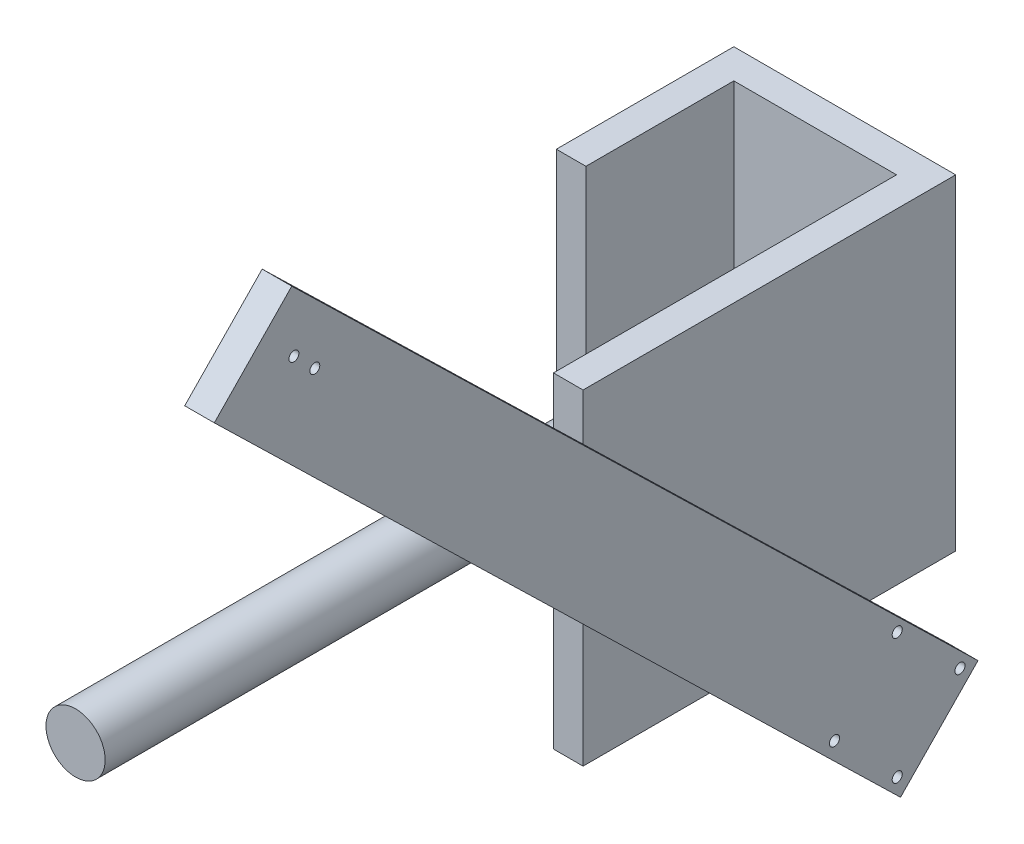
ISO-10303-21;
HEADER;
FILE_DESCRIPTION(('STEP AP214'),'2;1');
FILE_NAME('part.step','',(''),(''),'','','');
FILE_SCHEMA(('AUTOMOTIVE_DESIGN { 1 0 10303 214 1 1 1 1 }'));
ENDSEC;
DATA;
#1=APPLICATION_CONTEXT('core data for automotive mechanical design processes');
#2=APPLICATION_PROTOCOL_DEFINITION('international standard','automotive_design',2000,#1);
#3=PRODUCT_CONTEXT('',#1,'mechanical');
#4=PRODUCT('Part','Part','',(#3));
#5=PRODUCT_RELATED_PRODUCT_CATEGORY('part','',(#4));
#6=PRODUCT_DEFINITION_FORMATION('','',#4);
#7=PRODUCT_DEFINITION_CONTEXT('part definition',#1,'design');
#8=PRODUCT_DEFINITION('design','',#6,#7);
#9=PRODUCT_DEFINITION_SHAPE('','',#8);
#10=(LENGTH_UNIT() NAMED_UNIT(*) SI_UNIT(.MILLI.,.METRE.));
#11=(NAMED_UNIT(*) PLANE_ANGLE_UNIT() SI_UNIT($,.RADIAN.));
#12=(NAMED_UNIT(*) SI_UNIT($,.STERADIAN.) SOLID_ANGLE_UNIT());
#13=UNCERTAINTY_MEASURE_WITH_UNIT(LENGTH_MEASURE(1.E-05),#10,'distance_accuracy_value','');
#14=(GEOMETRIC_REPRESENTATION_CONTEXT(3) GLOBAL_UNCERTAINTY_ASSIGNED_CONTEXT((#13)) GLOBAL_UNIT_ASSIGNED_CONTEXT((#10,
#11,#12)) REPRESENTATION_CONTEXT('',''));
#15=CARTESIAN_POINT('',(0.,0.,0.));
#16=DIRECTION('',(0.,0.,1.));
#17=DIRECTION('',(1.,0.,0.));
#18=AXIS2_PLACEMENT_3D('',#15,#16,#17);
#19=CARTESIAN_POINT('',(-23107.0117553606,5158.44312124506,40788.6350298594));
#20=DIRECTION('',(0.,0.,-1.));
#21=DIRECTION('',(-1.,0.,0.));
#22=AXIS2_PLACEMENT_3D('',#19,#20,#21);
#23=PLANE('',#22);
#24=CARTESIAN_POINT('',(-23032.0117553604,5268.56584962768,40788.6350298594));
#25=DIRECTION('',(0.,0.,-1.));
#26=DIRECTION('',(-1.,0.,0.));
#27=AXIS2_PLACEMENT_3D('',#24,#25,#26);
#28=CIRCLE('',#27,20.000000000001);
#29=CARTESIAN_POINT('',(-23052.0117553604,5268.56584962768,40788.6350298594));
#30=VERTEX_POINT('',#29);
#31=EDGE_CURVE('E11',#30,#30,#28,.F.);
#32=ORIENTED_EDGE('',*,*,#31,.F.);
#33=EDGE_LOOP('',(#32));
#34=FACE_BOUND('',#33,.T.);
#35=DIRECTION('',(0.,1.,0.));
#36=VECTOR('',#35,1.);
#37=CARTESIAN_POINT('',(-23087.0117553604,5158.44312124506,40788.6350298594));
#38=LINE('',#37,#36);
#39=CARTESIAN_POINT('',(-23087.0117553604,5158.44312124506,40788.6350298594));
#40=VERTEX_POINT('',#39);
#41=CARTESIAN_POINT('',(-23087.0117553604,5378.6885780103,40788.6350298594));
#42=VERTEX_POINT('',#41);
#43=EDGE_CURVE('E178',#40,#42,#38,.T.);
#44=ORIENTED_EDGE('',*,*,#43,.F.);
#45=DIRECTION('',(1.,0.,0.));
#46=VECTOR('',#45,1.);
#47=CARTESIAN_POINT('',(-23107.0117553606,5158.44312124506,40788.6350298594));
#48=LINE('',#47,#46);
#49=CARTESIAN_POINT('',(-22977.0117553606,5158.44312124506,40788.6350298594));
#50=VERTEX_POINT('',#49);
#51=EDGE_CURVE('E162',#40,#50,#48,.T.);
#52=ORIENTED_EDGE('',*,*,#51,.T.);
#53=DIRECTION('',(0.,-1.,0.));
#54=VECTOR('',#53,1.);
#55=CARTESIAN_POINT('',(-22977.0117553606,0.,40788.6350298594));
#56=LINE('',#55,#54);
#57=CARTESIAN_POINT('',(-22977.0117553606,5378.6885780103,40788.6350298594));
#58=VERTEX_POINT('',#57);
#59=EDGE_CURVE('E208',#58,#50,#56,.T.);
#60=ORIENTED_EDGE('',*,*,#59,.F.);
#61=DIRECTION('',(1.,0.,0.));
#62=VECTOR('',#61,1.);
#63=CARTESIAN_POINT('',(-23107.0117553606,5378.6885780103,40788.6350298594));
#64=LINE('',#63,#62);
#65=EDGE_CURVE('E202',#42,#58,#64,.T.);
#66=ORIENTED_EDGE('',*,*,#65,.F.);
#67=EDGE_LOOP('',(#44,#52,#60,#66));
#68=FACE_BOUND('',#67,.T.);
#69=ADVANCED_FACE('F41',(#34,#68),#23,.F.);
#70=CARTESIAN_POINT('',(-22957.0117553606,0.,0.));
#71=DIRECTION('',(-1.,0.,0.));
#72=DIRECTION('',(0.,0.,1.));
#73=AXIS2_PLACEMENT_3D('',#70,#71,#72);
#74=PLANE('',#73);
#75=CARTESIAN_POINT('',(-22957.0117553606,5516.1957411759,41236.0441361524));
#76=DIRECTION('',(-1.,0.,0.));
#77=DIRECTION('',(0.,0.,1.));
#78=AXIS2_PLACEMENT_3D('',#75,#76,#77);
#79=CIRCLE('',#78,3.34999999999804);
#80=CARTESIAN_POINT('',(-22957.0117553606,5516.1957411759,41239.3941361524));
#81=VERTEX_POINT('',#80);
#82=EDGE_CURVE('E262',#81,#81,#79,.T.);
#83=ORIENTED_EDGE('',*,*,#82,.F.);
#84=EDGE_LOOP('',(#83));
#85=FACE_BOUND('',#84,.T.);
#86=CARTESIAN_POINT('',(-22957.0117553606,5502.05360554933,41221.9020005312));
#87=DIRECTION('',(-1.,0.,0.));
#88=DIRECTION('',(0.,0.,1.));
#89=AXIS2_PLACEMENT_3D('',#86,#87,#88);
#90=CIRCLE('',#89,3.34999999999804);
#91=CARTESIAN_POINT('',(-22957.0117553606,5502.05360554933,41225.2520005312));
#92=VERTEX_POINT('',#91);
#93=EDGE_CURVE('E256',#92,#92,#90,.T.);
#94=ORIENTED_EDGE('',*,*,#93,.F.);
#95=EDGE_LOOP('',(#94));
#96=FACE_BOUND('',#95,.T.);
#97=DIRECTION('',(0.,-0.697191762299266,-0.716884681508849));
#98=VECTOR('',#97,1.);
#99=CARTESIAN_POINT('',(-22957.0117553606,5557.92935885637,41237.4947792562));
#100=LINE('',#99,#98);
#101=CARTESIAN_POINT('',(-22957.0117553606,5557.92935885637,41237.4947792562));
#102=VERTEX_POINT('',#101);
#103=CARTESIAN_POINT('',(-22957.0117553606,5346.95821498608,41020.5645321428));
#104=VERTEX_POINT('',#103);
#105=EDGE_CURVE('E95',#102,#104,#100,.T.);
#106=ORIENTED_EDGE('',*,*,#105,.T.);
#107=DIRECTION('',(0.,-1.,0.));
#108=VECTOR('',#107,1.);
#109=CARTESIAN_POINT('',(-22957.0117553606,0.,41020.5645321428));
#110=LINE('',#109,#108);
#111=CARTESIAN_POINT('',(-22957.0117553606,5242.18978609648,41020.5645321428));
#112=VERTEX_POINT('',#111);
#113=EDGE_CURVE('E49',#104,#112,#110,.T.);
#114=ORIENTED_EDGE('',*,*,#113,.T.);
#115=DIRECTION('',(0.,0.697191762299266,0.716884681508849));
#116=VECTOR('',#115,1.);
#117=CARTESIAN_POINT('',(-22957.0117553606,5052.91093336638,40825.9392978912));
#118=LINE('',#117,#116);
#119=CARTESIAN_POINT('',(-22957.0117553606,5504.08638583475,41289.8586785229));
#120=VERTEX_POINT('',#119);
#121=EDGE_CURVE('E65',#112,#120,#118,.T.);
#122=ORIENTED_EDGE('',*,*,#121,.T.);
#123=DIRECTION('',(0.,0.716884681508848,-0.697191762299267));
#124=VECTOR('',#123,1.);
#125=CARTESIAN_POINT('',(-22957.0117553606,5504.08638583475,41289.8586785229));
#126=LINE('',#125,#124);
#127=EDGE_CURVE('E268',#120,#102,#126,.T.);
#128=ORIENTED_EDGE('',*,*,#127,.T.);
#129=EDGE_LOOP('',(#106,#114,#122,#128));
#130=FACE_BOUND('',#129,.T.);
#131=ADVANCED_FACE('F311',(#85,#96,#130),#74,.T.);
#132=CARTESIAN_POINT('',(-22957.0117553606,5108.32224656892,40785.7442346742));
#133=DIRECTION('',(-1.,0.,0.));
#134=DIRECTION('',(0.,0.,1.));
#135=AXIS2_PLACEMENT_3D('',#132,#133,#134);
#136=CIRCLE('',#135,3.39999999999935);
#137=CARTESIAN_POINT('',(-22957.0117553606,5108.32224656892,40789.1442346742));
#138=VERTEX_POINT('',#137);
#139=EDGE_CURVE('E232',#138,#138,#136,.T.);
#140=ORIENTED_EDGE('',*,*,#139,.F.);
#141=EDGE_LOOP('',(#140));
#142=FACE_BOUND('',#141,.T.);
#143=CARTESIAN_POINT('',(-22957.0117553606,5065.89583969773,40828.1706415454));
#144=DIRECTION('',(-1.,0.,0.));
#145=DIRECTION('',(0.,0.,1.));
#146=AXIS2_PLACEMENT_3D('',#143,#144,#145);
#147=CIRCLE('',#146,3.39999999999935);
#148=CARTESIAN_POINT('',(-22957.0117553606,5065.89583969773,40831.5706415454));
#149=VERTEX_POINT('',#148);
#150=EDGE_CURVE('E244',#149,#149,#147,.T.);
#151=ORIENTED_EDGE('',*,*,#150,.F.);
#152=EDGE_LOOP('',(#151));
#153=FACE_BOUND('',#152,.T.);
#154=CARTESIAN_POINT('',(-22957.0117553606,5108.32224656892,40870.5970484166));
#155=DIRECTION('',(-1.,0.,0.));
#156=DIRECTION('',(0.,0.,1.));
#157=AXIS2_PLACEMENT_3D('',#154,#155,#156);
#158=CIRCLE('',#157,3.39999999999204);
#159=CARTESIAN_POINT('',(-22957.0117553606,5108.32224656892,40873.9970484166));
#160=VERTEX_POINT('',#159);
#161=EDGE_CURVE('E250',#160,#160,#158,.T.);
#162=ORIENTED_EDGE('',*,*,#161,.F.);
#163=EDGE_LOOP('',(#162));
#164=FACE_BOUND('',#163,.T.);
#165=CARTESIAN_POINT('',(-22957.0117553606,5150.74865344011,40828.1706415454));
#166=DIRECTION('',(-1.,0.,0.));
#167=DIRECTION('',(0.,0.,1.));
#168=AXIS2_PLACEMENT_3D('',#165,#166,#167);
#169=CIRCLE('',#168,3.39999999999935);
#170=CARTESIAN_POINT('',(-22957.0117553606,5150.74865344011,40831.5706415454));
#171=VERTEX_POINT('',#170);
#172=EDGE_CURVE('E238',#171,#171,#169,.T.);
#173=ORIENTED_EDGE('',*,*,#172,.F.);
#174=EDGE_LOOP('',(#173));
#175=FACE_BOUND('',#174,.T.);
#176=CARTESIAN_POINT('',(-22957.0117553606,5052.91093336638,40825.9392978912));
#177=VERTEX_POINT('',#176);
#178=CARTESIAN_POINT('',(-22957.0117553606,5158.44312124506,40934.4523541081));
#179=VERTEX_POINT('',#178);
#180=EDGE_CURVE('E275',#177,#179,#118,.T.);
#181=ORIENTED_EDGE('',*,*,#180,.T.);
#182=DIRECTION('',(0.,0.,-1.));
#183=VECTOR('',#182,1.);
#184=CARTESIAN_POINT('',(-22957.0117553606,5158.44312124506,0.));
#185=LINE('',#184,#183);
#186=CARTESIAN_POINT('',(-22957.0117553606,5158.44312124506,40826.7246300613));
#187=VERTEX_POINT('',#186);
#188=EDGE_CURVE('E224',#179,#187,#185,.T.);
#189=ORIENTED_EDGE('',*,*,#188,.T.);
#190=CARTESIAN_POINT('',(-22957.0117553606,5106.75390638799,40773.5753986245));
#191=VERTEX_POINT('',#190);
#192=EDGE_CURVE('E270',#187,#191,#100,.T.);
#193=ORIENTED_EDGE('',*,*,#192,.T.);
#194=DIRECTION('',(0.,-0.716884681508848,0.697191762299267));
#195=VECTOR('',#194,1.);
#196=CARTESIAN_POINT('',(-22957.0117553606,5106.75390638799,40773.5753986245));
#197=LINE('',#196,#195);
#198=EDGE_CURVE('E272',#191,#177,#197,.T.);
#199=ORIENTED_EDGE('',*,*,#198,.T.);
#200=EDGE_LOOP('',(#181,#189,#193,#199));
#201=FACE_BOUND('',#200,.T.);
#202=ADVANCED_FACE('F344',(#142,#153,#164,#175,#201),#74,.T.);
#203=CARTESIAN_POINT('',(-22937.0117553606,0.,0.));
#204=DIRECTION('',(-1.,0.,0.));
#205=DIRECTION('',(0.,0.,1.));
#206=AXIS2_PLACEMENT_3D('',#203,#204,#205);
#207=PLANE('',#206);
#208=DIRECTION('',(0.,0.716884681508848,-0.697191762299267));
#209=VECTOR('',#208,1.);
#210=CARTESIAN_POINT('',(-22937.0117553606,5504.08638583475,41289.8586785229));
#211=LINE('',#210,#209);
#212=CARTESIAN_POINT('',(-22937.0117553606,5504.08638583475,41289.8586785229));
#213=VERTEX_POINT('',#212);
#214=CARTESIAN_POINT('',(-22937.0117553606,5557.92935885637,41237.4947792562));
#215=VERTEX_POINT('',#214);
#216=EDGE_CURVE('E265',#213,#215,#211,.T.);
#217=ORIENTED_EDGE('',*,*,#216,.F.);
#218=DIRECTION('',(0.,0.697191762299266,0.716884681508849));
#219=VECTOR('',#218,1.);
#220=CARTESIAN_POINT('',(-22937.0117553606,5052.91093336638,40825.9392978912));
#221=LINE('',#220,#219);
#222=CARTESIAN_POINT('',(-22937.0117553606,5052.91093336638,40825.9392978912));
#223=VERTEX_POINT('',#222);
#224=EDGE_CURVE('E87',#223,#213,#221,.T.);
#225=ORIENTED_EDGE('',*,*,#224,.F.);
#226=DIRECTION('',(0.,-0.716884681508848,0.697191762299267));
#227=VECTOR('',#226,1.);
#228=CARTESIAN_POINT('',(-22937.0117553606,5106.75390638799,40773.5753986245));
#229=LINE('',#228,#227);
#230=CARTESIAN_POINT('',(-22937.0117553606,5106.75390638799,40773.5753986245));
#231=VERTEX_POINT('',#230);
#232=EDGE_CURVE('E284',#231,#223,#229,.T.);
#233=ORIENTED_EDGE('',*,*,#232,.F.);
#234=DIRECTION('',(0.,-0.697191762299266,-0.716884681508849));
#235=VECTOR('',#234,1.);
#236=CARTESIAN_POINT('',(-22937.0117553606,5557.92935885637,41237.4947792562));
#237=LINE('',#236,#235);
#238=EDGE_CURVE('E282',#215,#231,#237,.T.);
#239=ORIENTED_EDGE('',*,*,#238,.F.);
#240=EDGE_LOOP('',(#217,#225,#233,#239));
#241=FACE_BOUND('',#240,.T.);
#242=CARTESIAN_POINT('',(-22937.0117553606,5516.1957411759,41236.0441361524));
#243=DIRECTION('',(-1.,0.,0.));
#244=DIRECTION('',(0.,0.,1.));
#245=AXIS2_PLACEMENT_3D('',#242,#243,#244);
#246=CIRCLE('',#245,3.34999999999804);
#247=CARTESIAN_POINT('',(-22937.0117553606,5516.1957411759,41239.3941361524));
#248=VERTEX_POINT('',#247);
#249=EDGE_CURVE('E259',#248,#248,#246,.T.);
#250=ORIENTED_EDGE('',*,*,#249,.T.);
#251=EDGE_LOOP('',(#250));
#252=FACE_BOUND('',#251,.T.);
#253=CARTESIAN_POINT('',(-22937.0117553606,5502.05360554933,41221.9020005312));
#254=DIRECTION('',(-1.,0.,0.));
#255=DIRECTION('',(0.,0.,1.));
#256=AXIS2_PLACEMENT_3D('',#253,#254,#255);
#257=CIRCLE('',#256,3.34999999999804);
#258=CARTESIAN_POINT('',(-22937.0117553606,5502.05360554933,41225.2520005312));
#259=VERTEX_POINT('',#258);
#260=EDGE_CURVE('E253',#259,#259,#257,.T.);
#261=ORIENTED_EDGE('',*,*,#260,.T.);
#262=EDGE_LOOP('',(#261));
#263=FACE_BOUND('',#262,.T.);
#264=CARTESIAN_POINT('',(-22937.0117553606,5108.32224656892,40870.5970484166));
#265=DIRECTION('',(-1.,0.,0.));
#266=DIRECTION('',(0.,0.,1.));
#267=AXIS2_PLACEMENT_3D('',#264,#265,#266);
#268=CIRCLE('',#267,3.39999999999204);
#269=CARTESIAN_POINT('',(-22937.0117553606,5108.32224656892,40873.9970484166));
#270=VERTEX_POINT('',#269);
#271=EDGE_CURVE('E247',#270,#270,#268,.T.);
#272=ORIENTED_EDGE('',*,*,#271,.T.);
#273=EDGE_LOOP('',(#272));
#274=FACE_BOUND('',#273,.T.);
#275=CARTESIAN_POINT('',(-22937.0117553606,5065.89583969773,40828.1706415454));
#276=DIRECTION('',(-1.,0.,0.));
#277=DIRECTION('',(0.,0.,1.));
#278=AXIS2_PLACEMENT_3D('',#275,#276,#277);
#279=CIRCLE('',#278,3.39999999999935);
#280=CARTESIAN_POINT('',(-22937.0117553606,5065.89583969773,40831.5706415454));
#281=VERTEX_POINT('',#280);
#282=EDGE_CURVE('E241',#281,#281,#279,.T.);
#283=ORIENTED_EDGE('',*,*,#282,.T.);
#284=EDGE_LOOP('',(#283));
#285=FACE_BOUND('',#284,.T.);
#286=CARTESIAN_POINT('',(-22937.0117553606,5150.74865344011,40828.1706415454));
#287=DIRECTION('',(-1.,0.,0.));
#288=DIRECTION('',(0.,0.,1.));
#289=AXIS2_PLACEMENT_3D('',#286,#287,#288);
#290=CIRCLE('',#289,3.39999999999935);
#291=CARTESIAN_POINT('',(-22937.0117553606,5150.74865344011,40831.5706415454));
#292=VERTEX_POINT('',#291);
#293=EDGE_CURVE('E235',#292,#292,#290,.T.);
#294=ORIENTED_EDGE('',*,*,#293,.T.);
#295=EDGE_LOOP('',(#294));
#296=FACE_BOUND('',#295,.T.);
#297=CARTESIAN_POINT('',(-22937.0117553606,5108.32224656892,40785.7442346742));
#298=DIRECTION('',(-1.,0.,0.));
#299=DIRECTION('',(0.,0.,1.));
#300=AXIS2_PLACEMENT_3D('',#297,#298,#299);
#301=CIRCLE('',#300,3.39999999999935);
#302=CARTESIAN_POINT('',(-22937.0117553606,5108.32224656892,40789.1442346742));
#303=VERTEX_POINT('',#302);
#304=EDGE_CURVE('E231',#303,#303,#301,.T.);
#305=ORIENTED_EDGE('',*,*,#304,.T.);
#306=EDGE_LOOP('',(#305));
#307=FACE_BOUND('',#306,.T.);
#308=ADVANCED_FACE('F384',(#241,#252,#263,#274,#285,#296,#307),#207,.F.);
#309=CARTESIAN_POINT('',(-22957.0117553606,5504.08638583475,41289.8586785229));
#310=DIRECTION('',(0.,-0.697191762299267,-0.716884681508848));
#311=DIRECTION('',(0.,0.716884681508848,-0.697191762299267));
#312=AXIS2_PLACEMENT_3D('',#309,#310,#311);
#313=PLANE('',#312);
#314=ORIENTED_EDGE('',*,*,#216,.T.);
#315=DIRECTION('',(1.,0.,0.));
#316=VECTOR('',#315,1.);
#317=CARTESIAN_POINT('',(-22957.0117553606,5557.92935885637,41237.4947792562));
#318=LINE('',#317,#316);
#319=EDGE_CURVE('E292',#102,#215,#318,.T.);
#320=ORIENTED_EDGE('',*,*,#319,.F.);
#321=ORIENTED_EDGE('',*,*,#127,.F.);
#322=DIRECTION('',(1.,0.,0.));
#323=VECTOR('',#322,1.);
#324=CARTESIAN_POINT('',(-22957.0117553606,5504.08638583475,41289.8586785229));
#325=LINE('',#324,#323);
#326=EDGE_CURVE('E278',#120,#213,#325,.T.);
#327=ORIENTED_EDGE('',*,*,#326,.T.);
#328=EDGE_LOOP('',(#314,#320,#321,#327));
#329=FACE_BOUND('',#328,.T.);
#330=ADVANCED_FACE('F43',(#329),#313,.F.);
#331=CARTESIAN_POINT('',(-22957.0117553606,5557.92935885637,41237.4947792562));
#332=DIRECTION('',(0.,-0.716884681508849,0.697191762299266));
#333=DIRECTION('',(0.,-0.697191762299266,-0.716884681508849));
#334=AXIS2_PLACEMENT_3D('',#331,#332,#333);
#335=PLANE('',#334);
#336=ORIENTED_EDGE('',*,*,#238,.T.);
#337=DIRECTION('',(1.,0.,0.));
#338=VECTOR('',#337,1.);
#339=CARTESIAN_POINT('',(-22957.0117553606,5106.75390638799,40773.5753986245));
#340=LINE('',#339,#338);
#341=EDGE_CURVE('E290',#191,#231,#340,.T.);
#342=ORIENTED_EDGE('',*,*,#341,.F.);
#343=ORIENTED_EDGE('',*,*,#192,.F.);
#344=EDGE_CURVE('E273',#104,#187,#100,.T.);
#345=ORIENTED_EDGE('',*,*,#344,.F.);
#346=ORIENTED_EDGE('',*,*,#105,.F.);
#347=ORIENTED_EDGE('',*,*,#319,.T.);
#348=EDGE_LOOP('',(#336,#342,#343,#345,#346,#347));
#349=FACE_BOUND('',#348,.T.);
#350=ADVANCED_FACE('F392',(#349),#335,.F.);
#351=CARTESIAN_POINT('',(-22957.0117553606,5106.75390638799,40773.5753986245));
#352=DIRECTION('',(0.,0.697191762299267,0.716884681508848));
#353=DIRECTION('',(0.,-0.716884681508848,0.697191762299267));
#354=AXIS2_PLACEMENT_3D('',#351,#352,#353);
#355=PLANE('',#354);
#356=ORIENTED_EDGE('',*,*,#232,.T.);
#357=DIRECTION('',(1.,0.,0.));
#358=VECTOR('',#357,1.);
#359=CARTESIAN_POINT('',(-22957.0117553606,5052.91093336638,40825.9392978912));
#360=LINE('',#359,#358);
#361=EDGE_CURVE('E288',#177,#223,#360,.T.);
#362=ORIENTED_EDGE('',*,*,#361,.F.);
#363=ORIENTED_EDGE('',*,*,#198,.F.);
#364=ORIENTED_EDGE('',*,*,#341,.T.);
#365=EDGE_LOOP('',(#356,#362,#363,#364));
#366=FACE_BOUND('',#365,.T.);
#367=ADVANCED_FACE('F390',(#366),#355,.F.);
#368=CARTESIAN_POINT('',(-22957.0117553606,5052.91093336638,40825.9392978912));
#369=DIRECTION('',(0.,0.716884681508849,-0.697191762299266));
#370=DIRECTION('',(0.,0.697191762299266,0.716884681508849));
#371=AXIS2_PLACEMENT_3D('',#368,#369,#370);
#372=PLANE('',#371);
#373=ORIENTED_EDGE('',*,*,#224,.T.);
#374=ORIENTED_EDGE('',*,*,#326,.F.);
#375=ORIENTED_EDGE('',*,*,#121,.F.);
#376=EDGE_CURVE('E279',#179,#112,#118,.T.);
#377=ORIENTED_EDGE('',*,*,#376,.F.);
#378=ORIENTED_EDGE('',*,*,#180,.F.);
#379=ORIENTED_EDGE('',*,*,#361,.T.);
#380=EDGE_LOOP('',(#373,#374,#375,#377,#378,#379));
#381=FACE_BOUND('',#380,.T.);
#382=ADVANCED_FACE('F313',(#381),#372,.F.);
#383=CARTESIAN_POINT('',(-22957.0117553606,5516.1957411759,41236.0441361524));
#384=DIRECTION('',(1.,0.,0.));
#385=DIRECTION('',(0.,0.,-1.));
#386=AXIS2_PLACEMENT_3D('',#383,#384,#385);
#387=CYLINDRICAL_SURFACE('',#386,3.34999999999804);
#388=ORIENTED_EDGE('',*,*,#82,.T.);
#389=EDGE_LOOP('',(#388));
#390=FACE_BOUND('',#389,.T.);
#391=ORIENTED_EDGE('',*,*,#249,.F.);
#392=EDGE_LOOP('',(#391));
#393=FACE_BOUND('',#392,.T.);
#394=ADVANCED_FACE('F379',(#390,#393),#387,.F.);
#395=CARTESIAN_POINT('',(-22957.0117553606,5502.05360554933,41221.9020005312));
#396=DIRECTION('',(1.,0.,0.));
#397=DIRECTION('',(0.,0.,-1.));
#398=AXIS2_PLACEMENT_3D('',#395,#396,#397);
#399=CYLINDRICAL_SURFACE('',#398,3.34999999999804);
#400=ORIENTED_EDGE('',*,*,#93,.T.);
#401=EDGE_LOOP('',(#400));
#402=FACE_BOUND('',#401,.T.);
#403=ORIENTED_EDGE('',*,*,#260,.F.);
#404=EDGE_LOOP('',(#403));
#405=FACE_BOUND('',#404,.T.);
#406=ADVANCED_FACE('F375',(#402,#405),#399,.F.);
#407=CARTESIAN_POINT('',(-22957.0117553606,5108.32224656892,40870.5970484166));
#408=DIRECTION('',(1.,0.,0.));
#409=DIRECTION('',(0.,0.,-1.));
#410=AXIS2_PLACEMENT_3D('',#407,#408,#409);
#411=CYLINDRICAL_SURFACE('',#410,3.39999999999204);
#412=ORIENTED_EDGE('',*,*,#161,.T.);
#413=EDGE_LOOP('',(#412));
#414=FACE_BOUND('',#413,.T.);
#415=ORIENTED_EDGE('',*,*,#271,.F.);
#416=EDGE_LOOP('',(#415));
#417=FACE_BOUND('',#416,.T.);
#418=ADVANCED_FACE('F371',(#414,#417),#411,.F.);
#419=CARTESIAN_POINT('',(-22957.0117553606,5065.89583969773,40828.1706415454));
#420=DIRECTION('',(1.,0.,0.));
#421=DIRECTION('',(0.,0.,-1.));
#422=AXIS2_PLACEMENT_3D('',#419,#420,#421);
#423=CYLINDRICAL_SURFACE('',#422,3.39999999999935);
#424=ORIENTED_EDGE('',*,*,#150,.T.);
#425=EDGE_LOOP('',(#424));
#426=FACE_BOUND('',#425,.T.);
#427=ORIENTED_EDGE('',*,*,#282,.F.);
#428=EDGE_LOOP('',(#427));
#429=FACE_BOUND('',#428,.T.);
#430=ADVANCED_FACE('F367',(#426,#429),#423,.F.);
#431=CARTESIAN_POINT('',(-22957.0117553606,5150.74865344011,40828.1706415454));
#432=DIRECTION('',(1.,0.,0.));
#433=DIRECTION('',(0.,0.,-1.));
#434=AXIS2_PLACEMENT_3D('',#431,#432,#433);
#435=CYLINDRICAL_SURFACE('',#434,3.39999999999935);
#436=ORIENTED_EDGE('',*,*,#172,.T.);
#437=EDGE_LOOP('',(#436));
#438=FACE_BOUND('',#437,.T.);
#439=ORIENTED_EDGE('',*,*,#293,.F.);
#440=EDGE_LOOP('',(#439));
#441=FACE_BOUND('',#440,.T.);
#442=ADVANCED_FACE('F363',(#438,#441),#435,.F.);
#443=CARTESIAN_POINT('',(-22957.0117553606,5108.32224656892,40785.7442346742));
#444=DIRECTION('',(1.,0.,0.));
#445=DIRECTION('',(0.,0.,-1.));
#446=AXIS2_PLACEMENT_3D('',#443,#444,#445);
#447=CYLINDRICAL_SURFACE('',#446,3.39999999999935);
#448=ORIENTED_EDGE('',*,*,#139,.T.);
#449=EDGE_LOOP('',(#448));
#450=FACE_BOUND('',#449,.T.);
#451=ORIENTED_EDGE('',*,*,#304,.F.);
#452=EDGE_LOOP('',(#451));
#453=FACE_BOUND('',#452,.T.);
#454=ADVANCED_FACE('F354',(#450,#453),#447,.F.);
#455=CARTESIAN_POINT('',(-22957.0117553606,0.,0.));
#456=DIRECTION('',(-1.,0.,0.));
#457=DIRECTION('',(0.,0.,1.));
#458=AXIS2_PLACEMENT_3D('',#455,#456,#457);
#459=PLANE('',#458);
#460=CARTESIAN_POINT('',(-22957.0117553606,5378.6885780103,41020.5645321428));
#461=VERTEX_POINT('',#460);
#462=EDGE_CURVE('E209',#461,#104,#110,.T.);
#463=ORIENTED_EDGE('',*,*,#462,.T.);
#464=ORIENTED_EDGE('',*,*,#344,.T.);
#465=CARTESIAN_POINT('',(-22957.0117553606,5158.44312124506,40768.6350298594));
#466=VERTEX_POINT('',#465);
#467=EDGE_CURVE('E56',#187,#466,#185,.T.);
#468=ORIENTED_EDGE('',*,*,#467,.T.);
#469=DIRECTION('',(0.,-1.,0.));
#470=VECTOR('',#469,1.);
#471=CARTESIAN_POINT('',(-22957.0117553606,5158.44312124506,40768.6350298594));
#472=LINE('',#471,#470);
#473=CARTESIAN_POINT('',(-22957.0117553606,5378.6885780103,40768.6350298594));
#474=VERTEX_POINT('',#473);
#475=EDGE_CURVE('E190',#474,#466,#472,.T.);
#476=ORIENTED_EDGE('',*,*,#475,.F.);
#477=DIRECTION('',(0.,0.,-1.));
#478=VECTOR('',#477,1.);
#479=CARTESIAN_POINT('',(-22957.0117553606,5378.6885780103,0.));
#480=LINE('',#479,#478);
#481=EDGE_CURVE('E204',#461,#474,#480,.T.);
#482=ORIENTED_EDGE('',*,*,#481,.F.);
#483=EDGE_LOOP('',(#463,#464,#468,#476,#482));
#484=FACE_BOUND('',#483,.T.);
#485=ADVANCED_FACE('F299',(#484),#459,.F.);
#486=CARTESIAN_POINT('',(-22957.0117553606,5158.44312124506,41020.5645321428));
#487=VERTEX_POINT('',#486);
#488=EDGE_CURVE('E220',#487,#179,#185,.T.);
#489=ORIENTED_EDGE('',*,*,#488,.T.);
#490=ORIENTED_EDGE('',*,*,#376,.T.);
#491=EDGE_CURVE('E223',#112,#487,#110,.T.);
#492=ORIENTED_EDGE('',*,*,#491,.T.);
#493=EDGE_LOOP('',(#489,#490,#492));
#494=FACE_BOUND('',#493,.T.);
#495=ADVANCED_FACE('F317',(#494),#459,.F.);
#496=CARTESIAN_POINT('',(-22977.0117553606,5378.6885780103,0.));
#497=DIRECTION('',(0.,-1.,0.));
#498=DIRECTION('',(0.,0.,-1.));
#499=AXIS2_PLACEMENT_3D('',#496,#497,#498);
#500=PLANE('',#499);
#501=ORIENTED_EDGE('',*,*,#481,.T.);
#502=DIRECTION('',(1.,0.,0.));
#503=VECTOR('',#502,1.);
#504=CARTESIAN_POINT('',(-23107.0117553606,5378.6885780103,40768.6350298594));
#505=LINE('',#504,#503);
#506=CARTESIAN_POINT('',(-23107.0117553606,5378.6885780103,40768.6350298594));
#507=VERTEX_POINT('',#506);
#508=EDGE_CURVE('E199',#507,#474,#505,.T.);
#509=ORIENTED_EDGE('',*,*,#508,.F.);
#510=DIRECTION('',(0.,0.,-1.));
#511=VECTOR('',#510,1.);
#512=CARTESIAN_POINT('',(-23107.0117553606,5378.6885780103,40788.6350298594));
#513=LINE('',#512,#511);
#514=CARTESIAN_POINT('',(-23107.0117553604,5378.6885780103,40888.6350298594));
#515=VERTEX_POINT('',#514);
#516=EDGE_CURVE('E191',#515,#507,#513,.T.);
#517=ORIENTED_EDGE('',*,*,#516,.F.);
#518=DIRECTION('',(-1.,0.,0.));
#519=VECTOR('',#518,1.);
#520=CARTESIAN_POINT('',(-23107.0117553604,5378.6885780103,40888.6350298594));
#521=LINE('',#520,#519);
#522=CARTESIAN_POINT('',(-23087.0117553604,5378.6885780103,40888.6350298594));
#523=VERTEX_POINT('',#522);
#524=EDGE_CURVE('E177',#523,#515,#521,.T.);
#525=ORIENTED_EDGE('',*,*,#524,.F.);
#526=DIRECTION('',(0.,0.,-1.));
#527=VECTOR('',#526,1.);
#528=CARTESIAN_POINT('',(-23087.0117553604,5378.6885780103,40888.6350298594));
#529=LINE('',#528,#527);
#530=EDGE_CURVE('E185',#523,#42,#529,.T.);
#531=ORIENTED_EDGE('',*,*,#530,.T.);
#532=ORIENTED_EDGE('',*,*,#65,.T.);
#533=DIRECTION('',(0.,0.,-1.));
#534=VECTOR('',#533,1.);
#535=CARTESIAN_POINT('',(-22977.0117553606,5378.6885780103,0.));
#536=LINE('',#535,#534);
#537=CARTESIAN_POINT('',(-22977.0117553606,5378.6885780103,41020.5645321428));
#538=VERTEX_POINT('',#537);
#539=EDGE_CURVE('E205',#538,#58,#536,.T.);
#540=ORIENTED_EDGE('',*,*,#539,.F.);
#541=DIRECTION('',(1.,0.,0.));
#542=VECTOR('',#541,1.);
#543=CARTESIAN_POINT('',(-22977.0117553606,5378.6885780103,41020.5645321428));
#544=LINE('',#543,#542);
#545=EDGE_CURVE('E218',#538,#461,#544,.T.);
#546=ORIENTED_EDGE('',*,*,#545,.T.);
#547=EDGE_LOOP('',(#501,#509,#517,#525,#531,#532,#540,#546));
#548=FACE_BOUND('',#547,.T.);
#549=ADVANCED_FACE('F305',(#548),#500,.F.);
#550=CARTESIAN_POINT('',(-22977.0117553606,5158.44312124506,0.));
#551=DIRECTION('',(0.,-1.,0.));
#552=DIRECTION('',(0.,0.,-1.));
#553=AXIS2_PLACEMENT_3D('',#550,#551,#552);
#554=PLANE('',#553);
#555=ORIENTED_EDGE('',*,*,#488,.F.);
#556=DIRECTION('',(1.,0.,0.));
#557=VECTOR('',#556,1.);
#558=CARTESIAN_POINT('',(-22977.0117553606,5158.44312124506,41020.5645321428));
#559=LINE('',#558,#557);
#560=CARTESIAN_POINT('',(-22977.0117553606,5158.44312124506,41020.5645321428));
#561=VERTEX_POINT('',#560);
#562=EDGE_CURVE('E228',#561,#487,#559,.T.);
#563=ORIENTED_EDGE('',*,*,#562,.F.);
#564=DIRECTION('',(0.,0.,-1.));
#565=VECTOR('',#564,1.);
#566=CARTESIAN_POINT('',(-22977.0117553606,5158.44312124506,0.));
#567=LINE('',#566,#565);
#568=EDGE_CURVE('E212',#561,#50,#567,.T.);
#569=ORIENTED_EDGE('',*,*,#568,.T.);
#570=ORIENTED_EDGE('',*,*,#51,.F.);
#571=DIRECTION('',(0.,0.,-1.));
#572=VECTOR('',#571,1.);
#573=CARTESIAN_POINT('',(-23087.0117553604,5158.44312124506,40888.6350298594));
#574=LINE('',#573,#572);
#575=CARTESIAN_POINT('',(-23087.0117553604,5158.44312124506,40888.6350298594));
#576=VERTEX_POINT('',#575);
#577=EDGE_CURVE('E169',#576,#40,#574,.T.);
#578=ORIENTED_EDGE('',*,*,#577,.F.);
#579=DIRECTION('',(1.,0.,0.));
#580=VECTOR('',#579,1.);
#581=CARTESIAN_POINT('',(-23107.0117553604,5158.44312124506,40888.6350298594));
#582=LINE('',#581,#580);
#583=CARTESIAN_POINT('',(-23107.0117553604,5158.44312124506,40888.6350298594));
#584=VERTEX_POINT('',#583);
#585=EDGE_CURVE('E165',#584,#576,#582,.T.);
#586=ORIENTED_EDGE('',*,*,#585,.F.);
#587=DIRECTION('',(0.,0.,1.));
#588=VECTOR('',#587,1.);
#589=CARTESIAN_POINT('',(-23107.0117553606,5158.44312124506,40788.6350298594));
#590=LINE('',#589,#588);
#591=CARTESIAN_POINT('',(-23107.0117553606,5158.44312124506,40768.6350298594));
#592=VERTEX_POINT('',#591);
#593=EDGE_CURVE('E154',#592,#584,#590,.T.);
#594=ORIENTED_EDGE('',*,*,#593,.F.);
#595=DIRECTION('',(1.,0.,0.));
#596=VECTOR('',#595,1.);
#597=CARTESIAN_POINT('',(-23107.0117553606,5158.44312124506,40768.6350298594));
#598=LINE('',#597,#596);
#599=EDGE_CURVE('E197',#592,#466,#598,.T.);
#600=ORIENTED_EDGE('',*,*,#599,.T.);
#601=ORIENTED_EDGE('',*,*,#467,.F.);
#602=ORIENTED_EDGE('',*,*,#188,.F.);
#603=EDGE_LOOP('',(#555,#563,#569,#570,#578,#586,#594,#600,#601,#602));
#604=FACE_BOUND('',#603,.T.);
#605=ADVANCED_FACE('F167',(#604),#554,.T.);
#606=CARTESIAN_POINT('',(-22977.0117553606,0.,41020.5645321428));
#607=DIRECTION('',(0.,0.,1.));
#608=DIRECTION('',(1.,0.,0.));
#609=AXIS2_PLACEMENT_3D('',#606,#607,#608);
#610=PLANE('',#609);
#611=ORIENTED_EDGE('',*,*,#462,.F.);
#612=ORIENTED_EDGE('',*,*,#545,.F.);
#613=DIRECTION('',(0.,-1.,0.));
#614=VECTOR('',#613,1.);
#615=CARTESIAN_POINT('',(-22977.0117553606,0.,41020.5645321428));
#616=LINE('',#615,#614);
#617=EDGE_CURVE('E215',#538,#561,#616,.T.);
#618=ORIENTED_EDGE('',*,*,#617,.T.);
#619=ORIENTED_EDGE('',*,*,#562,.T.);
#620=ORIENTED_EDGE('',*,*,#491,.F.);
#621=ORIENTED_EDGE('',*,*,#113,.F.);
#622=EDGE_LOOP('',(#611,#612,#618,#619,#620,#621));
#623=FACE_BOUND('',#622,.T.);
#624=ADVANCED_FACE('F309',(#623),#610,.T.);
#625=CARTESIAN_POINT('',(-22977.0117553606,0.,0.));
#626=DIRECTION('',(-1.,0.,0.));
#627=DIRECTION('',(0.,0.,1.));
#628=AXIS2_PLACEMENT_3D('',#625,#626,#627);
#629=PLANE('',#628);
#630=ORIENTED_EDGE('',*,*,#539,.T.);
#631=ORIENTED_EDGE('',*,*,#59,.T.);
#632=ORIENTED_EDGE('',*,*,#568,.F.);
#633=ORIENTED_EDGE('',*,*,#617,.F.);
#634=EDGE_LOOP('',(#630,#631,#632,#633));
#635=FACE_BOUND('',#634,.T.);
#636=ADVANCED_FACE('F321',(#635),#629,.T.);
#637=CARTESIAN_POINT('',(-23107.0117553606,5158.44312124506,40768.6350298594));
#638=DIRECTION('',(0.,0.,1.));
#639=DIRECTION('',(1.,0.,0.));
#640=AXIS2_PLACEMENT_3D('',#637,#638,#639);
#641=PLANE('',#640);
#642=ORIENTED_EDGE('',*,*,#475,.T.);
#643=ORIENTED_EDGE('',*,*,#599,.F.);
#644=DIRECTION('',(0.,-1.,0.));
#645=VECTOR('',#644,1.);
#646=CARTESIAN_POINT('',(-23107.0117553606,5158.44312124506,40768.6350298594));
#647=LINE('',#646,#645);
#648=EDGE_CURVE('E160',#507,#592,#647,.T.);
#649=ORIENTED_EDGE('',*,*,#648,.F.);
#650=ORIENTED_EDGE('',*,*,#508,.T.);
#651=EDGE_LOOP('',(#642,#643,#649,#650));
#652=FACE_BOUND('',#651,.T.);
#653=ADVANCED_FACE('F302',(#652),#641,.F.);
#654=CARTESIAN_POINT('',(-23107.0117553606,0.,0.));
#655=DIRECTION('',(-1.,0.,0.));
#656=DIRECTION('',(0.,0.,1.));
#657=AXIS2_PLACEMENT_3D('',#654,#655,#656);
#658=PLANE('',#657);
#659=ORIENTED_EDGE('',*,*,#593,.T.);
#660=DIRECTION('',(0.,-1.,0.));
#661=VECTOR('',#660,1.);
#662=CARTESIAN_POINT('',(-23107.0117553604,5158.44312124506,40888.6350298594));
#663=LINE('',#662,#661);
#664=EDGE_CURVE('E158',#515,#584,#663,.T.);
#665=ORIENTED_EDGE('',*,*,#664,.F.);
#666=ORIENTED_EDGE('',*,*,#516,.T.);
#667=ORIENTED_EDGE('',*,*,#648,.T.);
#668=EDGE_LOOP('',(#659,#665,#666,#667));
#669=FACE_BOUND('',#668,.T.);
#670=ADVANCED_FACE('F156',(#669),#658,.T.);
#671=CARTESIAN_POINT('',(-23087.0117553604,5158.44312124506,40888.6350298594));
#672=DIRECTION('',(-1.,0.,0.));
#673=DIRECTION('',(0.,0.,1.));
#674=AXIS2_PLACEMENT_3D('',#671,#672,#673);
#675=PLANE('',#674);
#676=ORIENTED_EDGE('',*,*,#43,.T.);
#677=ORIENTED_EDGE('',*,*,#530,.F.);
#678=DIRECTION('',(0.,1.,0.));
#679=VECTOR('',#678,1.);
#680=CARTESIAN_POINT('',(-23087.0117553604,5158.44312124506,40888.6350298594));
#681=LINE('',#680,#679);
#682=EDGE_CURVE('E172',#576,#523,#681,.T.);
#683=ORIENTED_EDGE('',*,*,#682,.F.);
#684=ORIENTED_EDGE('',*,*,#577,.T.);
#685=EDGE_LOOP('',(#676,#677,#683,#684));
#686=FACE_BOUND('',#685,.T.);
#687=ADVANCED_FACE('F328',(#686),#675,.F.);
#688=CARTESIAN_POINT('',(0.,0.,40888.6350298594));
#689=DIRECTION('',(0.,0.,-1.));
#690=DIRECTION('',(-1.,0.,0.));
#691=AXIS2_PLACEMENT_3D('',#688,#689,#690);
#692=PLANE('',#691);
#693=ORIENTED_EDGE('',*,*,#664,.T.);
#694=ORIENTED_EDGE('',*,*,#585,.T.);
#695=ORIENTED_EDGE('',*,*,#682,.T.);
#696=ORIENTED_EDGE('',*,*,#524,.T.);
#697=EDGE_LOOP('',(#693,#694,#695,#696));
#698=FACE_BOUND('',#697,.T.);
#699=ADVANCED_FACE('F175',(#698),#692,.F.);
#700=CARTESIAN_POINT('',(-23032.0117553604,5268.56584962768,41288.6350298594));
#701=DIRECTION('',(0.,0.,-1.));
#702=DIRECTION('',(-1.,0.,0.));
#703=AXIS2_PLACEMENT_3D('',#700,#701,#702);
#704=CYLINDRICAL_SURFACE('',#703,20.000000000001);
#705=CARTESIAN_POINT('',(-23032.0117553604,5268.56584962768,41288.6350298594));
#706=DIRECTION('',(0.,0.,1.));
#707=DIRECTION('',(1.,0.,0.));
#708=AXIS2_PLACEMENT_3D('',#705,#706,#707);
#709=CIRCLE('',#708,20.000000000001);
#710=CARTESIAN_POINT('',(-23012.0117553604,5268.56584962768,41288.6350298594));
#711=VERTEX_POINT('',#710);
#712=EDGE_CURVE('E180',#711,#711,#709,.T.);
#713=ORIENTED_EDGE('',*,*,#712,.F.);
#714=EDGE_LOOP('',(#713));
#715=FACE_BOUND('',#714,.T.);
#716=ORIENTED_EDGE('',*,*,#31,.T.);
#717=EDGE_LOOP('',(#716));
#718=FACE_BOUND('',#717,.T.);
#719=ADVANCED_FACE('F335',(#715,#718),#704,.T.);
#720=CARTESIAN_POINT('',(-23032.0117553604,5268.56584962768,41288.6350298594));
#721=DIRECTION('',(0.,0.,1.));
#722=DIRECTION('',(1.,0.,0.));
#723=AXIS2_PLACEMENT_3D('',#720,#721,#722);
#724=PLANE('',#723);
#725=ORIENTED_EDGE('',*,*,#712,.T.);
#726=EDGE_LOOP('',(#725));
#727=FACE_BOUND('',#726,.T.);
#728=ADVANCED_FACE('F583',(#727),#724,.T.);
#729=CLOSED_SHELL('',(#69,#131,#202,#308,#330,#350,#367,#382,#394,#406,#418,#430,#442,#454,#485,
#495,#549,#605,#624,#636,#653,#670,#687,#699,#719,#728));
#730=MANIFOLD_SOLID_BREP('B2',#729);
#731=ADVANCED_BREP_SHAPE_REPRESENTATION('',(#18,#730),#14);
#732=SHAPE_DEFINITION_REPRESENTATION(#9,#731);
ENDSEC;
END-ISO-10303-21;
